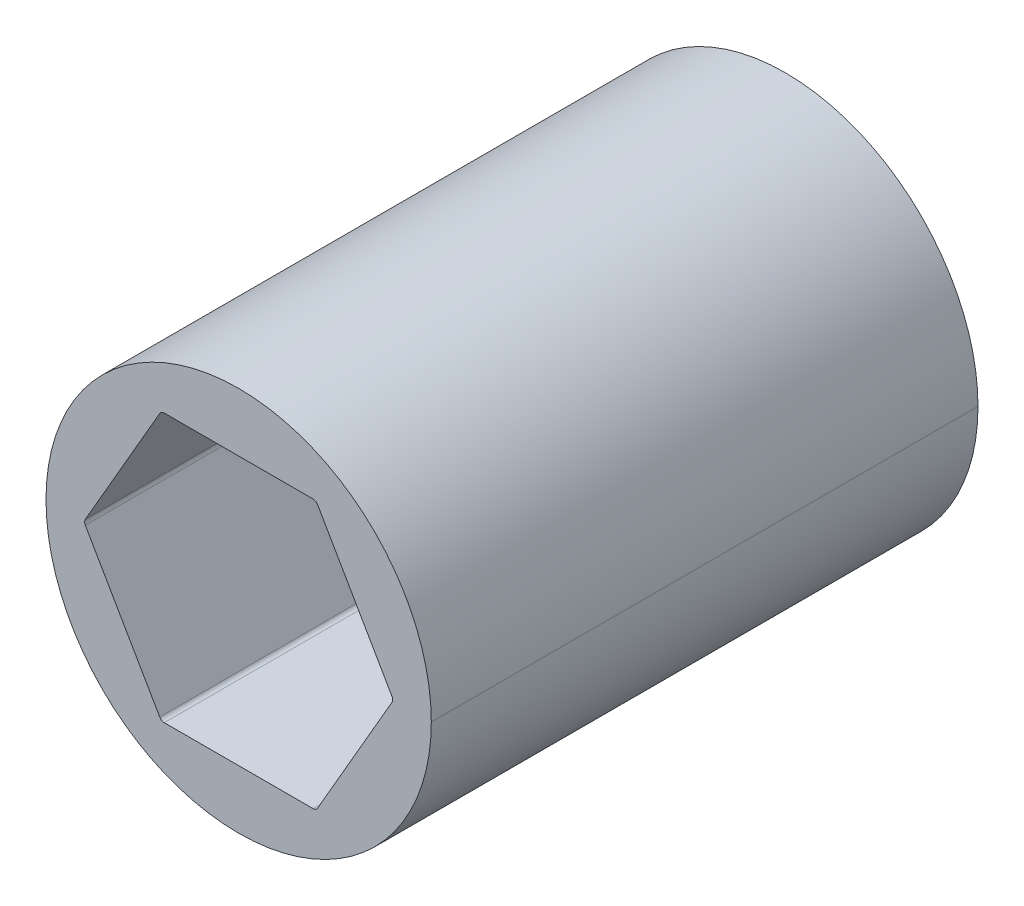
ISO-10303-21;
HEADER;
FILE_DESCRIPTION(('STEP AP214'),'2;1');
FILE_NAME('part.step','',(''),(''),'','','');
FILE_SCHEMA(('AUTOMOTIVE_DESIGN { 1 0 10303 214 1 1 1 1 }'));
ENDSEC;
DATA;
#1=APPLICATION_CONTEXT('core data for automotive mechanical design processes');
#2=APPLICATION_PROTOCOL_DEFINITION('international standard','automotive_design',2000,#1);
#3=PRODUCT_CONTEXT('',#1,'mechanical');
#4=PRODUCT('Part','Part','',(#3));
#5=PRODUCT_RELATED_PRODUCT_CATEGORY('part','',(#4));
#6=PRODUCT_DEFINITION_FORMATION('','',#4);
#7=PRODUCT_DEFINITION_CONTEXT('part definition',#1,'design');
#8=PRODUCT_DEFINITION('design','',#6,#7);
#9=PRODUCT_DEFINITION_SHAPE('','',#8);
#10=(LENGTH_UNIT() NAMED_UNIT(*) SI_UNIT(.MILLI.,.METRE.));
#11=(NAMED_UNIT(*) PLANE_ANGLE_UNIT() SI_UNIT($,.RADIAN.));
#12=(NAMED_UNIT(*) SI_UNIT($,.STERADIAN.) SOLID_ANGLE_UNIT());
#13=UNCERTAINTY_MEASURE_WITH_UNIT(LENGTH_MEASURE(1.E-05),#10,'distance_accuracy_value','');
#14=(GEOMETRIC_REPRESENTATION_CONTEXT(3) GLOBAL_UNCERTAINTY_ASSIGNED_CONTEXT((#13)) GLOBAL_UNIT_ASSIGNED_CONTEXT((#10,
#11,#12)) REPRESENTATION_CONTEXT('',''));
#15=CARTESIAN_POINT('',(0.,0.,0.));
#16=DIRECTION('',(0.,0.,1.));
#17=DIRECTION('',(1.,0.,0.));
#18=AXIS2_PLACEMENT_3D('',#15,#16,#17);
#19=CARTESIAN_POINT('',(7.25902493452117,0.,30.48));
#20=DIRECTION('',(0.,0.,1.));
#21=DIRECTION('',(1.,0.,0.));
#22=AXIS2_PLACEMENT_3D('',#19,#20,#21);
#23=CYLINDRICAL_SURFACE('',#22,0.254);
#24=CARTESIAN_POINT('',(7.25902493452117,0.,26.67));
#25=DIRECTION('',(0.,0.,1.));
#26=DIRECTION('',(1.,0.,0.));
#27=AXIS2_PLACEMENT_3D('',#24,#25,#26);
#28=CIRCLE('',#27,0.254);
#29=CARTESIAN_POINT('',(7.47899538708242,0.127,26.67));
#30=VERTEX_POINT('',#29);
#31=CARTESIAN_POINT('',(7.51302493452117,0.,26.67));
#32=VERTEX_POINT('',#31);
#33=EDGE_CURVE('E303',#30,#32,#28,.F.);
#34=ORIENTED_EDGE('',*,*,#33,.F.);
#35=DIRECTION('',(0.,0.,1.));
#36=VECTOR('',#35,1.);
#37=CARTESIAN_POINT('',(7.47899538708242,0.127,30.48));
#38=LINE('',#37,#36);
#39=CARTESIAN_POINT('',(7.47899538708242,0.127,0.));
#40=VERTEX_POINT('',#39);
#41=EDGE_CURVE('E269',#40,#30,#38,.T.);
#42=ORIENTED_EDGE('',*,*,#41,.F.);
#43=CARTESIAN_POINT('',(7.25902493452117,0.,0.));
#44=DIRECTION('',(0.,0.,1.));
#45=DIRECTION('',(1.,0.,0.));
#46=AXIS2_PLACEMENT_3D('',#43,#44,#45);
#47=CIRCLE('',#46,0.254);
#48=CARTESIAN_POINT('',(7.51302493452117,0.,0.));
#49=VERTEX_POINT('',#48);
#50=EDGE_CURVE('E201',#49,#40,#47,.T.);
#51=ORIENTED_EDGE('',*,*,#50,.F.);
#52=DIRECTION('',(0.,0.,1.));
#53=VECTOR('',#52,1.);
#54=CARTESIAN_POINT('',(7.51302493452117,0.,30.48));
#55=LINE('',#54,#53);
#56=EDGE_CURVE('E54',#49,#32,#55,.T.);
#57=ORIENTED_EDGE('',*,*,#56,.T.);
#58=EDGE_LOOP('',(#34,#42,#51,#57));
#59=FACE_BOUND('',#58,.T.);
#60=ADVANCED_FACE('F45',(#59),#23,.F.);
#61=CARTESIAN_POINT('',(0.,0.,30.48));
#62=DIRECTION('',(0.,0.,-1.));
#63=DIRECTION('',(-1.,0.,0.));
#64=AXIS2_PLACEMENT_3D('',#61,#62,#63);
#65=CYLINDRICAL_SURFACE('',#64,9.398);
#66=DIRECTION('',(0.,0.,-1.));
#67=VECTOR('',#66,1.);
#68=CARTESIAN_POINT('',(-9.398,0.,30.48));
#69=LINE('',#68,#67);
#70=CARTESIAN_POINT('',(-9.398,0.,26.67));
#71=VERTEX_POINT('',#70);
#72=CARTESIAN_POINT('',(-9.398,0.,0.));
#73=VERTEX_POINT('',#72);
#74=EDGE_CURVE('E176',#71,#73,#69,.T.);
#75=ORIENTED_EDGE('',*,*,#74,.F.);
#76=CARTESIAN_POINT('',(0.,0.,26.67));
#77=DIRECTION('',(0.,0.,1.));
#78=DIRECTION('',(1.,0.,0.));
#79=AXIS2_PLACEMENT_3D('',#76,#77,#78);
#80=CIRCLE('',#79,9.398);
#81=CARTESIAN_POINT('',(9.398,0.,26.67));
#82=VERTEX_POINT('',#81);
#83=EDGE_CURVE('E60',#82,#71,#80,.T.);
#84=ORIENTED_EDGE('',*,*,#83,.F.);
#85=DIRECTION('',(0.,0.,-1.));
#86=VECTOR('',#85,1.);
#87=CARTESIAN_POINT('',(9.398,0.,30.48));
#88=LINE('',#87,#86);
#89=CARTESIAN_POINT('',(9.398,0.,0.));
#90=VERTEX_POINT('',#89);
#91=EDGE_CURVE('E174',#82,#90,#88,.T.);
#92=ORIENTED_EDGE('',*,*,#91,.T.);
#93=CARTESIAN_POINT('',(0.,0.,0.));
#94=DIRECTION('',(0.,0.,1.));
#95=DIRECTION('',(1.,0.,0.));
#96=AXIS2_PLACEMENT_3D('',#93,#94,#95);
#97=CIRCLE('',#96,9.398);
#98=EDGE_CURVE('E183',#90,#73,#97,.T.);
#99=ORIENTED_EDGE('',*,*,#98,.T.);
#100=EDGE_LOOP('',(#75,#84,#92,#99));
#101=FACE_BOUND('',#100,.T.);
#102=ADVANCED_FACE('F172',(#101),#65,.T.);
#103=CARTESIAN_POINT('',(0.,0.,30.48));
#104=DIRECTION('',(0.,0.,-1.));
#105=DIRECTION('',(-1.,0.,0.));
#106=AXIS2_PLACEMENT_3D('',#103,#104,#105);
#107=CYLINDRICAL_SURFACE('',#106,9.398);
#108=ORIENTED_EDGE('',*,*,#91,.F.);
#109=EDGE_CURVE('E164',#71,#82,#80,.T.);
#110=ORIENTED_EDGE('',*,*,#109,.F.);
#111=ORIENTED_EDGE('',*,*,#74,.T.);
#112=CARTESIAN_POINT('',(0.,0.,0.));
#113=DIRECTION('',(0.,0.,1.));
#114=DIRECTION('',(1.,0.,0.));
#115=AXIS2_PLACEMENT_3D('',#112,#113,#114);
#116=CIRCLE('',#115,9.398);
#117=EDGE_CURVE('E181',#73,#90,#116,.T.);
#118=ORIENTED_EDGE('',*,*,#117,.T.);
#119=EDGE_LOOP('',(#108,#110,#111,#118));
#120=FACE_BOUND('',#119,.T.);
#121=ADVANCED_FACE('F179',(#120),#107,.T.);
#122=CARTESIAN_POINT('',(3.77615943563475,-6.5405,30.48));
#123=DIRECTION('',(-0.866025403784439,0.5,0.));
#124=DIRECTION('',(0.,0.,1.));
#125=AXIS2_PLACEMENT_3D('',#122,#123,#124);
#126=PLANE('',#125);
#127=DIRECTION('',(0.,0.,1.));
#128=VECTOR('',#127,1.);
#129=CARTESIAN_POINT('',(3.84948291982184,-6.4135,30.48));
#130=LINE('',#129,#128);
#131=CARTESIAN_POINT('',(3.84948291982184,-6.4135,0.));
#132=VERTEX_POINT('',#131);
#133=CARTESIAN_POINT('',(3.84948291982184,-6.4135,26.67));
#134=VERTEX_POINT('',#133);
#135=EDGE_CURVE('E220',#132,#134,#130,.T.);
#136=ORIENTED_EDGE('',*,*,#135,.T.);
#137=DIRECTION('',(0.5,0.866025403784439,0.));
#138=VECTOR('',#137,1.);
#139=CARTESIAN_POINT('',(3.77615943563475,-6.5405,26.67));
#140=LINE('',#139,#138);
#141=CARTESIAN_POINT('',(7.47899538708242,-0.127000000000001,26.67));
#142=VERTEX_POINT('',#141);
#143=EDGE_CURVE('E313',#134,#142,#140,.T.);
#144=ORIENTED_EDGE('',*,*,#143,.T.);
#145=DIRECTION('',(0.,0.,-1.));
#146=VECTOR('',#145,1.);
#147=CARTESIAN_POINT('',(7.47899538708242,-0.127,0.));
#148=LINE('',#147,#146);
#149=CARTESIAN_POINT('',(7.47899538708242,-0.127000000000001,0.));
#150=VERTEX_POINT('',#149);
#151=EDGE_CURVE('E224',#142,#150,#148,.T.);
#152=ORIENTED_EDGE('',*,*,#151,.T.);
#153=DIRECTION('',(0.5,0.866025403784439,0.));
#154=VECTOR('',#153,1.);
#155=CARTESIAN_POINT('',(3.77615943563475,-6.5405,0.));
#156=LINE('',#155,#154);
#157=EDGE_CURVE('E200',#132,#150,#156,.T.);
#158=ORIENTED_EDGE('',*,*,#157,.F.);
#159=EDGE_LOOP('',(#136,#144,#152,#158));
#160=FACE_BOUND('',#159,.T.);
#161=ADVANCED_FACE('F465',(#160),#126,.T.);
#162=CARTESIAN_POINT('',(7.5523188712695,0.,30.48));
#163=DIRECTION('',(-0.866025403784438,-0.5,0.));
#164=DIRECTION('',(-0.5,0.866025403784438,0.));
#165=AXIS2_PLACEMENT_3D('',#162,#163,#164);
#166=PLANE('',#165);
#167=ORIENTED_EDGE('',*,*,#41,.T.);
#168=DIRECTION('',(-0.5,0.866025403784438,0.));
#169=VECTOR('',#168,1.);
#170=CARTESIAN_POINT('',(7.5523188712695,0.,26.67));
#171=LINE('',#170,#169);
#172=CARTESIAN_POINT('',(3.84948291982183,6.4135,26.67));
#173=VERTEX_POINT('',#172);
#174=EDGE_CURVE('E298',#30,#173,#171,.T.);
#175=ORIENTED_EDGE('',*,*,#174,.T.);
#176=DIRECTION('',(0.,0.,-1.));
#177=VECTOR('',#176,1.);
#178=CARTESIAN_POINT('',(3.84948291982183,6.4135,0.));
#179=LINE('',#178,#177);
#180=CARTESIAN_POINT('',(3.84948291982183,6.4135,0.));
#181=VERTEX_POINT('',#180);
#182=EDGE_CURVE('E230',#173,#181,#179,.T.);
#183=ORIENTED_EDGE('',*,*,#182,.T.);
#184=DIRECTION('',(-0.5,0.866025403784438,0.));
#185=VECTOR('',#184,1.);
#186=CARTESIAN_POINT('',(7.5523188712695,0.,0.));
#187=LINE('',#186,#185);
#188=EDGE_CURVE('E228',#40,#181,#187,.T.);
#189=ORIENTED_EDGE('',*,*,#188,.F.);
#190=EDGE_LOOP('',(#167,#175,#183,#189));
#191=FACE_BOUND('',#190,.T.);
#192=ADVANCED_FACE('F297',(#191),#166,.T.);
#193=CARTESIAN_POINT('',(3.77615943563475,6.5405,30.48));
#194=DIRECTION('',(0.,-1.,0.));
#195=DIRECTION('',(0.,0.,-1.));
#196=AXIS2_PLACEMENT_3D('',#193,#194,#195);
#197=PLANE('',#196);
#198=DIRECTION('',(0.,0.,1.));
#199=VECTOR('',#198,1.);
#200=CARTESIAN_POINT('',(3.62951246726058,6.5405,30.48));
#201=LINE('',#200,#199);
#202=CARTESIAN_POINT('',(3.62951246726058,6.5405,0.));
#203=VERTEX_POINT('',#202);
#204=CARTESIAN_POINT('',(3.62951246726058,6.5405,26.67));
#205=VERTEX_POINT('',#204);
#206=EDGE_CURVE('E265',#203,#205,#201,.T.);
#207=ORIENTED_EDGE('',*,*,#206,.T.);
#208=DIRECTION('',(-1.,0.,0.));
#209=VECTOR('',#208,1.);
#210=CARTESIAN_POINT('',(3.77615943563475,6.5405,26.67));
#211=LINE('',#210,#209);
#212=CARTESIAN_POINT('',(-3.62951246726058,6.5405,26.67));
#213=VERTEX_POINT('',#212);
#214=EDGE_CURVE('E325',#205,#213,#211,.T.);
#215=ORIENTED_EDGE('',*,*,#214,.T.);
#216=DIRECTION('',(0.,0.,-1.));
#217=VECTOR('',#216,1.);
#218=CARTESIAN_POINT('',(-3.62951246726058,6.5405,0.));
#219=LINE('',#218,#217);
#220=CARTESIAN_POINT('',(-3.62951246726058,6.5405,0.));
#221=VERTEX_POINT('',#220);
#222=EDGE_CURVE('E270',#213,#221,#219,.T.);
#223=ORIENTED_EDGE('',*,*,#222,.T.);
#224=DIRECTION('',(-1.,0.,0.));
#225=VECTOR('',#224,1.);
#226=CARTESIAN_POINT('',(3.77615943563475,6.5405,0.));
#227=LINE('',#226,#225);
#228=EDGE_CURVE('E253',#203,#221,#227,.T.);
#229=ORIENTED_EDGE('',*,*,#228,.F.);
#230=EDGE_LOOP('',(#207,#215,#223,#229));
#231=FACE_BOUND('',#230,.T.);
#232=ADVANCED_FACE('F484',(#231),#197,.T.);
#233=CARTESIAN_POINT('',(-3.77615943563474,6.5405,30.48));
#234=DIRECTION('',(0.866025403784439,-0.5,0.));
#235=DIRECTION('',(0.,0.,-1.));
#236=AXIS2_PLACEMENT_3D('',#233,#234,#235);
#237=PLANE('',#236);
#238=DIRECTION('',(0.,0.,1.));
#239=VECTOR('',#238,1.);
#240=CARTESIAN_POINT('',(-3.84948291982183,6.4135,30.48));
#241=LINE('',#240,#239);
#242=CARTESIAN_POINT('',(-3.84948291982183,6.4135,0.));
#243=VERTEX_POINT('',#242);
#244=CARTESIAN_POINT('',(-3.84948291982183,6.4135,26.67));
#245=VERTEX_POINT('',#244);
#246=EDGE_CURVE('E194',#243,#245,#241,.T.);
#247=ORIENTED_EDGE('',*,*,#246,.T.);
#248=DIRECTION('',(-0.5,-0.866025403784439,0.));
#249=VECTOR('',#248,1.);
#250=CARTESIAN_POINT('',(-3.77615943563474,6.5405,26.67));
#251=LINE('',#250,#249);
#252=CARTESIAN_POINT('',(-7.47899538708242,0.127000000000006,26.67));
#253=VERTEX_POINT('',#252);
#254=EDGE_CURVE('E339',#245,#253,#251,.T.);
#255=ORIENTED_EDGE('',*,*,#254,.T.);
#256=DIRECTION('',(0.,0.,-1.));
#257=VECTOR('',#256,1.);
#258=CARTESIAN_POINT('',(-7.47899538708241,0.127000000000002,0.));
#259=LINE('',#258,#257);
#260=CARTESIAN_POINT('',(-7.47899538708241,0.127000000000003,0.));
#261=VERTEX_POINT('',#260);
#262=EDGE_CURVE('E243',#253,#261,#259,.T.);
#263=ORIENTED_EDGE('',*,*,#262,.T.);
#264=DIRECTION('',(-0.5,-0.866025403784439,0.));
#265=VECTOR('',#264,1.);
#266=CARTESIAN_POINT('',(-3.77615943563474,6.5405,0.));
#267=LINE('',#266,#265);
#268=EDGE_CURVE('E254',#243,#261,#267,.T.);
#269=ORIENTED_EDGE('',*,*,#268,.F.);
#270=EDGE_LOOP('',(#247,#255,#263,#269));
#271=FACE_BOUND('',#270,.T.);
#272=ADVANCED_FACE('F360',(#271),#237,.T.);
#273=CARTESIAN_POINT('',(-7.5523188712695,0.,30.48));
#274=DIRECTION('',(0.866025403784439,0.5,0.));
#275=DIRECTION('',(0.,0.,-1.));
#276=AXIS2_PLACEMENT_3D('',#273,#274,#275);
#277=PLANE('',#276);
#278=DIRECTION('',(0.,0.,1.));
#279=VECTOR('',#278,1.);
#280=CARTESIAN_POINT('',(-7.47899538708241,-0.126999999999998,30.48));
#281=LINE('',#280,#279);
#282=CARTESIAN_POINT('',(-7.47899538708241,-0.126999999999999,0.));
#283=VERTEX_POINT('',#282);
#284=CARTESIAN_POINT('',(-7.47899538708241,-0.126999999999998,26.67));
#285=VERTEX_POINT('',#284);
#286=EDGE_CURVE('E207',#283,#285,#281,.T.);
#287=ORIENTED_EDGE('',*,*,#286,.T.);
#288=DIRECTION('',(0.5,-0.866025403784439,0.));
#289=VECTOR('',#288,1.);
#290=CARTESIAN_POINT('',(-7.5523188712695,0.,26.67));
#291=LINE('',#290,#289);
#292=CARTESIAN_POINT('',(-3.84948291982184,-6.4135,26.67));
#293=VERTEX_POINT('',#292);
#294=EDGE_CURVE('E67',#285,#293,#291,.T.);
#295=ORIENTED_EDGE('',*,*,#294,.T.);
#296=DIRECTION('',(0.,0.,-1.));
#297=VECTOR('',#296,1.);
#298=CARTESIAN_POINT('',(-3.84948291982183,-6.4135,0.));
#299=LINE('',#298,#297);
#300=CARTESIAN_POINT('',(-3.84948291982183,-6.4135,0.));
#301=VERTEX_POINT('',#300);
#302=EDGE_CURVE('E211',#293,#301,#299,.T.);
#303=ORIENTED_EDGE('',*,*,#302,.T.);
#304=DIRECTION('',(0.5,-0.866025403784439,0.));
#305=VECTOR('',#304,1.);
#306=CARTESIAN_POINT('',(-7.5523188712695,0.,0.));
#307=LINE('',#306,#305);
#308=EDGE_CURVE('E219',#283,#301,#307,.T.);
#309=ORIENTED_EDGE('',*,*,#308,.F.);
#310=EDGE_LOOP('',(#287,#295,#303,#309));
#311=FACE_BOUND('',#310,.T.);
#312=ADVANCED_FACE('F346',(#311),#277,.T.);
#313=CARTESIAN_POINT('',(-3.77615943563474,-6.5405,30.48));
#314=DIRECTION('',(0.,1.,0.));
#315=DIRECTION('',(1.,0.,0.));
#316=AXIS2_PLACEMENT_3D('',#313,#314,#315);
#317=PLANE('',#316);
#318=DIRECTION('',(0.,0.,1.));
#319=VECTOR('',#318,1.);
#320=CARTESIAN_POINT('',(-3.62951246726058,-6.5405,30.48));
#321=LINE('',#320,#319);
#322=CARTESIAN_POINT('',(-3.62951246726058,-6.5405,0.));
#323=VERTEX_POINT('',#322);
#324=CARTESIAN_POINT('',(-3.62951246726058,-6.5405,26.67));
#325=VERTEX_POINT('',#324);
#326=EDGE_CURVE('E205',#323,#325,#321,.T.);
#327=ORIENTED_EDGE('',*,*,#326,.T.);
#328=DIRECTION('',(1.,0.,0.));
#329=VECTOR('',#328,1.);
#330=CARTESIAN_POINT('',(-3.77615943563474,-6.5405,26.67));
#331=LINE('',#330,#329);
#332=CARTESIAN_POINT('',(3.62951246726059,-6.5405,26.67));
#333=VERTEX_POINT('',#332);
#334=EDGE_CURVE('E329',#325,#333,#331,.T.);
#335=ORIENTED_EDGE('',*,*,#334,.T.);
#336=DIRECTION('',(0.,0.,-1.));
#337=VECTOR('',#336,1.);
#338=CARTESIAN_POINT('',(3.62951246726059,-6.5405,0.));
#339=LINE('',#338,#337);
#340=CARTESIAN_POINT('',(3.62951246726058,-6.5405,0.));
#341=VERTEX_POINT('',#340);
#342=EDGE_CURVE('E202',#333,#341,#339,.T.);
#343=ORIENTED_EDGE('',*,*,#342,.T.);
#344=DIRECTION('',(1.,0.,0.));
#345=VECTOR('',#344,1.);
#346=CARTESIAN_POINT('',(-3.77615943563474,-6.5405,0.));
#347=LINE('',#346,#345);
#348=EDGE_CURVE('E190',#323,#341,#347,.T.);
#349=ORIENTED_EDGE('',*,*,#348,.F.);
#350=EDGE_LOOP('',(#327,#335,#343,#349));
#351=FACE_BOUND('',#350,.T.);
#352=ADVANCED_FACE('F510',(#351),#317,.T.);
#353=CARTESIAN_POINT('',(3.62951246726058,6.2865,30.48));
#354=DIRECTION('',(0.,0.,1.));
#355=DIRECTION('',(1.,0.,0.));
#356=AXIS2_PLACEMENT_3D('',#353,#354,#355);
#357=CYLINDRICAL_SURFACE('',#356,0.254);
#358=CARTESIAN_POINT('',(3.62951246726058,6.2865,26.67));
#359=DIRECTION('',(0.,0.,1.));
#360=DIRECTION('',(1.,0.,0.));
#361=AXIS2_PLACEMENT_3D('',#358,#359,#360);
#362=CIRCLE('',#361,0.254);
#363=EDGE_CURVE('E319',#205,#173,#362,.F.);
#364=ORIENTED_EDGE('',*,*,#363,.F.);
#365=ORIENTED_EDGE('',*,*,#206,.F.);
#366=CARTESIAN_POINT('',(3.62951246726058,6.2865,0.));
#367=DIRECTION('',(0.,0.,1.));
#368=DIRECTION('',(1.,0.,0.));
#369=AXIS2_PLACEMENT_3D('',#366,#367,#368);
#370=CIRCLE('',#369,0.254);
#371=EDGE_CURVE('E258',#181,#203,#370,.T.);
#372=ORIENTED_EDGE('',*,*,#371,.F.);
#373=ORIENTED_EDGE('',*,*,#182,.F.);
#374=EDGE_LOOP('',(#364,#365,#372,#373));
#375=FACE_BOUND('',#374,.T.);
#376=ADVANCED_FACE('F519',(#375),#357,.F.);
#377=CARTESIAN_POINT('',(-3.62951246726058,6.2865,30.48));
#378=DIRECTION('',(0.,0.,1.));
#379=DIRECTION('',(1.,0.,0.));
#380=AXIS2_PLACEMENT_3D('',#377,#378,#379);
#381=CYLINDRICAL_SURFACE('',#380,0.254);
#382=CARTESIAN_POINT('',(-3.62951246726058,6.2865,26.67));
#383=DIRECTION('',(0.,0.,1.));
#384=DIRECTION('',(1.,0.,0.));
#385=AXIS2_PLACEMENT_3D('',#382,#383,#384);
#386=CIRCLE('',#385,0.254);
#387=EDGE_CURVE('E333',#245,#213,#386,.F.);
#388=ORIENTED_EDGE('',*,*,#387,.F.);
#389=ORIENTED_EDGE('',*,*,#246,.F.);
#390=CARTESIAN_POINT('',(-3.62951246726058,6.2865,0.));
#391=DIRECTION('',(0.,0.,1.));
#392=DIRECTION('',(1.,0.,0.));
#393=AXIS2_PLACEMENT_3D('',#390,#391,#392);
#394=CIRCLE('',#393,0.254);
#395=EDGE_CURVE('E249',#221,#243,#394,.T.);
#396=ORIENTED_EDGE('',*,*,#395,.F.);
#397=ORIENTED_EDGE('',*,*,#222,.F.);
#398=EDGE_LOOP('',(#388,#389,#396,#397));
#399=FACE_BOUND('',#398,.T.);
#400=ADVANCED_FACE('F528',(#399),#381,.F.);
#401=CARTESIAN_POINT('',(-3.62951246726058,-6.2865,30.48));
#402=DIRECTION('',(0.,0.,1.));
#403=DIRECTION('',(1.,0.,0.));
#404=AXIS2_PLACEMENT_3D('',#401,#402,#403);
#405=CYLINDRICAL_SURFACE('',#404,0.254);
#406=CARTESIAN_POINT('',(-3.62951246726058,-6.2865,26.67));
#407=DIRECTION('',(0.,0.,1.));
#408=DIRECTION('',(1.,0.,0.));
#409=AXIS2_PLACEMENT_3D('',#406,#407,#408);
#410=CIRCLE('',#409,0.254);
#411=EDGE_CURVE('E336',#325,#293,#410,.F.);
#412=ORIENTED_EDGE('',*,*,#411,.F.);
#413=ORIENTED_EDGE('',*,*,#326,.F.);
#414=CARTESIAN_POINT('',(-3.62951246726058,-6.2865,0.));
#415=DIRECTION('',(0.,0.,1.));
#416=DIRECTION('',(1.,0.,0.));
#417=AXIS2_PLACEMENT_3D('',#414,#415,#416);
#418=CIRCLE('',#417,0.254);
#419=EDGE_CURVE('E216',#301,#323,#418,.T.);
#420=ORIENTED_EDGE('',*,*,#419,.F.);
#421=ORIENTED_EDGE('',*,*,#302,.F.);
#422=EDGE_LOOP('',(#412,#413,#420,#421));
#423=FACE_BOUND('',#422,.T.);
#424=ADVANCED_FACE('F351',(#423),#405,.F.);
#425=CARTESIAN_POINT('',(3.62951246726059,-6.2865,30.48));
#426=DIRECTION('',(0.,0.,1.));
#427=DIRECTION('',(1.,0.,0.));
#428=AXIS2_PLACEMENT_3D('',#425,#426,#427);
#429=CYLINDRICAL_SURFACE('',#428,0.254);
#430=CARTESIAN_POINT('',(3.62951246726059,-6.2865,26.67));
#431=DIRECTION('',(0.,0.,1.));
#432=DIRECTION('',(1.,0.,0.));
#433=AXIS2_PLACEMENT_3D('',#430,#431,#432);
#434=CIRCLE('',#433,0.254);
#435=EDGE_CURVE('E322',#134,#333,#434,.F.);
#436=ORIENTED_EDGE('',*,*,#435,.F.);
#437=ORIENTED_EDGE('',*,*,#135,.F.);
#438=CARTESIAN_POINT('',(3.62951246726059,-6.2865,0.));
#439=DIRECTION('',(0.,0.,1.));
#440=DIRECTION('',(1.,0.,0.));
#441=AXIS2_PLACEMENT_3D('',#438,#439,#440);
#442=CIRCLE('',#441,0.254);
#443=EDGE_CURVE('E212',#341,#132,#442,.T.);
#444=ORIENTED_EDGE('',*,*,#443,.F.);
#445=ORIENTED_EDGE('',*,*,#342,.F.);
#446=EDGE_LOOP('',(#436,#437,#444,#445));
#447=FACE_BOUND('',#446,.T.);
#448=ADVANCED_FACE('F394',(#447),#429,.F.);
#449=CARTESIAN_POINT('',(7.25902493452117,0.,30.48));
#450=DIRECTION('',(0.,0.,1.));
#451=DIRECTION('',(1.,0.,0.));
#452=AXIS2_PLACEMENT_3D('',#449,#450,#451);
#453=CYLINDRICAL_SURFACE('',#452,0.254);
#454=CARTESIAN_POINT('',(7.25902493452117,0.,26.67));
#455=DIRECTION('',(0.,0.,1.));
#456=DIRECTION('',(1.,0.,0.));
#457=AXIS2_PLACEMENT_3D('',#454,#455,#456);
#458=CIRCLE('',#457,0.254);
#459=EDGE_CURVE('E206',#32,#142,#458,.F.);
#460=ORIENTED_EDGE('',*,*,#459,.F.);
#461=ORIENTED_EDGE('',*,*,#56,.F.);
#462=CARTESIAN_POINT('',(7.25902493452117,0.,0.));
#463=DIRECTION('',(0.,0.,1.));
#464=DIRECTION('',(1.,0.,0.));
#465=AXIS2_PLACEMENT_3D('',#462,#463,#464);
#466=CIRCLE('',#465,0.254);
#467=EDGE_CURVE('E196',#150,#49,#466,.T.);
#468=ORIENTED_EDGE('',*,*,#467,.F.);
#469=ORIENTED_EDGE('',*,*,#151,.F.);
#470=EDGE_LOOP('',(#460,#461,#468,#469));
#471=FACE_BOUND('',#470,.T.);
#472=ADVANCED_FACE('F309',(#471),#453,.F.);
#473=CARTESIAN_POINT('',(-7.25902493452117,0.,30.48));
#474=DIRECTION('',(0.,0.,1.));
#475=DIRECTION('',(1.,0.,0.));
#476=AXIS2_PLACEMENT_3D('',#473,#474,#475);
#477=CYLINDRICAL_SURFACE('',#476,0.254);
#478=CARTESIAN_POINT('',(-7.25902493452117,0.,26.67));
#479=DIRECTION('',(0.,0.,1.));
#480=DIRECTION('',(1.,0.,0.));
#481=AXIS2_PLACEMENT_3D('',#478,#479,#480);
#482=CIRCLE('',#481,0.254);
#483=EDGE_CURVE('E11',#285,#253,#482,.F.);
#484=ORIENTED_EDGE('',*,*,#483,.F.);
#485=ORIENTED_EDGE('',*,*,#286,.F.);
#486=CARTESIAN_POINT('',(-7.25902493452117,0.,0.));
#487=DIRECTION('',(0.,0.,1.));
#488=DIRECTION('',(1.,0.,0.));
#489=AXIS2_PLACEMENT_3D('',#486,#487,#488);
#490=CIRCLE('',#489,0.254);
#491=EDGE_CURVE('E240',#261,#283,#490,.T.);
#492=ORIENTED_EDGE('',*,*,#491,.F.);
#493=ORIENTED_EDGE('',*,*,#262,.F.);
#494=EDGE_LOOP('',(#484,#485,#492,#493));
#495=FACE_BOUND('',#494,.T.);
#496=ADVANCED_FACE('F47',(#495),#477,.F.);
#497=CARTESIAN_POINT('',(0.,0.,0.));
#498=DIRECTION('',(0.,0.,1.));
#499=DIRECTION('',(1.,0.,0.));
#500=AXIS2_PLACEMENT_3D('',#497,#498,#499);
#501=PLANE('',#500);
#502=ORIENTED_EDGE('',*,*,#117,.F.);
#503=ORIENTED_EDGE('',*,*,#98,.F.);
#504=EDGE_LOOP('',(#502,#503));
#505=FACE_BOUND('',#504,.T.);
#506=ORIENTED_EDGE('',*,*,#348,.T.);
#507=ORIENTED_EDGE('',*,*,#443,.T.);
#508=ORIENTED_EDGE('',*,*,#157,.T.);
#509=ORIENTED_EDGE('',*,*,#467,.T.);
#510=ORIENTED_EDGE('',*,*,#50,.T.);
#511=ORIENTED_EDGE('',*,*,#188,.T.);
#512=ORIENTED_EDGE('',*,*,#371,.T.);
#513=ORIENTED_EDGE('',*,*,#228,.T.);
#514=ORIENTED_EDGE('',*,*,#395,.T.);
#515=ORIENTED_EDGE('',*,*,#268,.T.);
#516=ORIENTED_EDGE('',*,*,#491,.T.);
#517=ORIENTED_EDGE('',*,*,#308,.T.);
#518=ORIENTED_EDGE('',*,*,#419,.T.);
#519=EDGE_LOOP('',(#506,#507,#508,#509,#510,#511,#512,#513,#514,#515,#516,#517,#518));
#520=FACE_BOUND('',#519,.T.);
#521=ADVANCED_FACE('F304',(#505,#520),#501,.F.);
#522=CARTESIAN_POINT('',(0.,0.,26.67));
#523=DIRECTION('',(0.,0.,1.));
#524=DIRECTION('',(1.,0.,0.));
#525=AXIS2_PLACEMENT_3D('',#522,#523,#524);
#526=PLANE('',#525);
#527=ORIENTED_EDGE('',*,*,#83,.T.);
#528=ORIENTED_EDGE('',*,*,#109,.T.);
#529=EDGE_LOOP('',(#527,#528));
#530=FACE_BOUND('',#529,.T.);
#531=ORIENTED_EDGE('',*,*,#459,.T.);
#532=ORIENTED_EDGE('',*,*,#143,.F.);
#533=ORIENTED_EDGE('',*,*,#435,.T.);
#534=ORIENTED_EDGE('',*,*,#334,.F.);
#535=ORIENTED_EDGE('',*,*,#411,.T.);
#536=ORIENTED_EDGE('',*,*,#294,.F.);
#537=ORIENTED_EDGE('',*,*,#483,.T.);
#538=ORIENTED_EDGE('',*,*,#254,.F.);
#539=ORIENTED_EDGE('',*,*,#387,.T.);
#540=ORIENTED_EDGE('',*,*,#214,.F.);
#541=ORIENTED_EDGE('',*,*,#363,.T.);
#542=ORIENTED_EDGE('',*,*,#174,.F.);
#543=ORIENTED_EDGE('',*,*,#33,.T.);
#544=EDGE_LOOP('',(#531,#532,#533,#534,#535,#536,#537,#538,#539,#540,#541,#542,#543));
#545=FACE_BOUND('',#544,.T.);
#546=ADVANCED_FACE('F165',(#530,#545),#526,.T.);
#547=CLOSED_SHELL('',(#60,#102,#121,#161,#192,#232,#272,#312,#352,#376,#400,#424,#448,#472,#496,
#521,#546));
#548=MANIFOLD_SOLID_BREP('B2',#547);
#549=ADVANCED_BREP_SHAPE_REPRESENTATION('',(#18,#548),#14);
#550=SHAPE_DEFINITION_REPRESENTATION(#9,#549);
ENDSEC;
END-ISO-10303-21;
